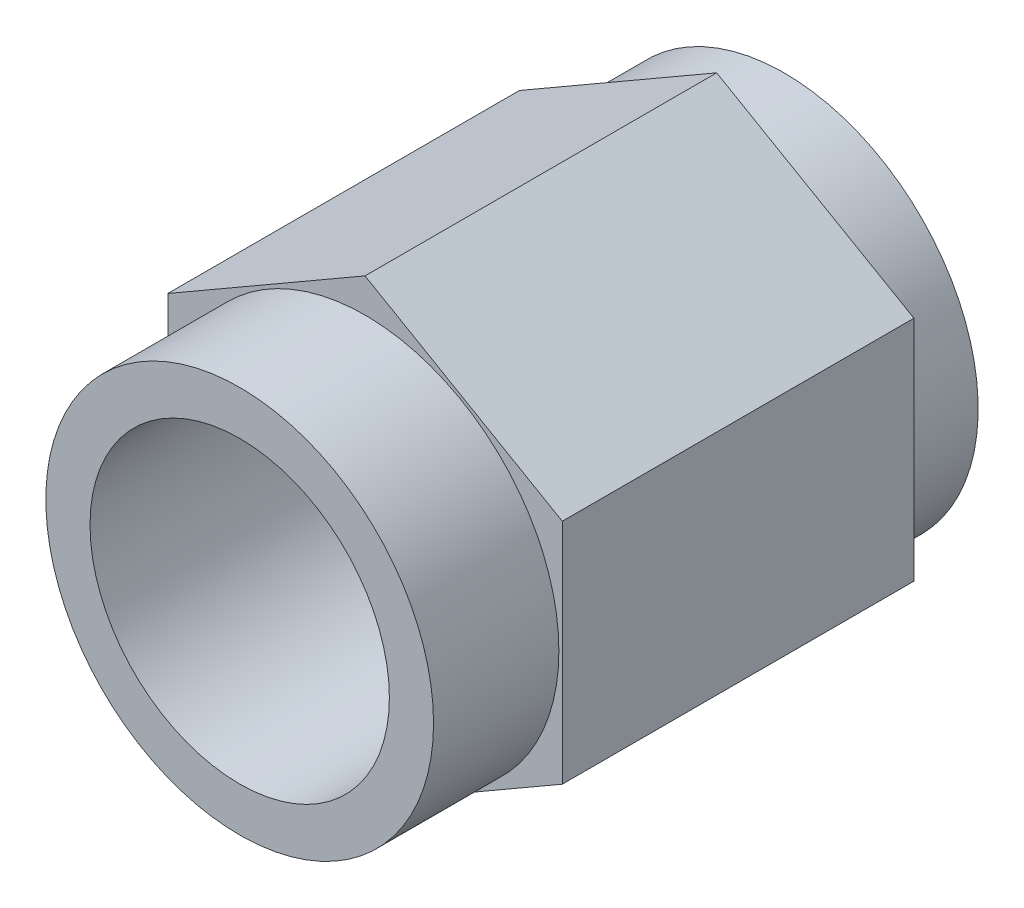
ISO-10303-21;
HEADER;
FILE_DESCRIPTION(('STEP AP214'),'2;1');
FILE_NAME('part.step','',(''),(''),'','','');
FILE_SCHEMA(('AUTOMOTIVE_DESIGN { 1 0 10303 214 1 1 1 1 }'));
ENDSEC;
DATA;
#1=APPLICATION_CONTEXT('core data for automotive mechanical design processes');
#2=APPLICATION_PROTOCOL_DEFINITION('international standard','automotive_design',2000,#1);
#3=PRODUCT_CONTEXT('',#1,'mechanical');
#4=PRODUCT('Part','Part','',(#3));
#5=PRODUCT_RELATED_PRODUCT_CATEGORY('part','',(#4));
#6=PRODUCT_DEFINITION_FORMATION('','',#4);
#7=PRODUCT_DEFINITION_CONTEXT('part definition',#1,'design');
#8=PRODUCT_DEFINITION('design','',#6,#7);
#9=PRODUCT_DEFINITION_SHAPE('','',#8);
#10=(LENGTH_UNIT() NAMED_UNIT(*) SI_UNIT(.MILLI.,.METRE.));
#11=(NAMED_UNIT(*) PLANE_ANGLE_UNIT() SI_UNIT($,.RADIAN.));
#12=(NAMED_UNIT(*) SI_UNIT($,.STERADIAN.) SOLID_ANGLE_UNIT());
#13=UNCERTAINTY_MEASURE_WITH_UNIT(LENGTH_MEASURE(1.E-05),#10,'distance_accuracy_value','');
#14=(GEOMETRIC_REPRESENTATION_CONTEXT(3) GLOBAL_UNCERTAINTY_ASSIGNED_CONTEXT((#13)) GLOBAL_UNIT_ASSIGNED_CONTEXT((#10,
#11,#12)) REPRESENTATION_CONTEXT('',''));
#15=CARTESIAN_POINT('',(0.,0.,0.));
#16=DIRECTION('',(0.,0.,1.));
#17=DIRECTION('',(1.,0.,0.));
#18=AXIS2_PLACEMENT_3D('',#15,#16,#17);
#19=CARTESIAN_POINT('',(0.,-6.41580486636972,11.811));
#20=DIRECTION('',(-0.5,0.866025403784439,0.));
#21=DIRECTION('',(-0.866025403784439,-0.5,0.));
#22=AXIS2_PLACEMENT_3D('',#19,#20,#21);
#23=PLANE('',#22);
#24=DIRECTION('',(-0.866025403784439,-0.5,0.));
#25=VECTOR('',#24,1.);
#26=CARTESIAN_POINT('',(0.,-6.41580486636972,1.905));
#27=LINE('',#26,#25);
#28=CARTESIAN_POINT('',(5.55625000000001,-3.20790243318485,1.905));
#29=VERTEX_POINT('',#28);
#30=CARTESIAN_POINT('',(0.,-6.41580486636972,1.905));
#31=VERTEX_POINT('',#30);
#32=EDGE_CURVE('E50',#29,#31,#27,.T.);
#33=ORIENTED_EDGE('',*,*,#32,.F.);
#34=DIRECTION('',(0.,0.,-1.));
#35=VECTOR('',#34,1.);
#36=CARTESIAN_POINT('',(5.55625000000001,-3.20790243318485,11.811));
#37=LINE('',#36,#35);
#38=CARTESIAN_POINT('',(5.55625000000001,-3.20790243318485,11.811));
#39=VERTEX_POINT('',#38);
#40=EDGE_CURVE('E44',#39,#29,#37,.T.);
#41=ORIENTED_EDGE('',*,*,#40,.F.);
#42=DIRECTION('',(0.866025403784439,0.5,0.));
#43=VECTOR('',#42,1.);
#44=CARTESIAN_POINT('',(0.,-6.41580486636972,11.811));
#45=LINE('',#44,#43);
#46=CARTESIAN_POINT('',(0.,-6.41580486636972,11.811));
#47=VERTEX_POINT('',#46);
#48=EDGE_CURVE('E144',#47,#39,#45,.T.);
#49=ORIENTED_EDGE('',*,*,#48,.F.);
#50=DIRECTION('',(0.,0.,-1.));
#51=VECTOR('',#50,1.);
#52=CARTESIAN_POINT('',(0.,-6.41580486636972,11.811));
#53=LINE('',#52,#51);
#54=EDGE_CURVE('E105',#47,#31,#53,.T.);
#55=ORIENTED_EDGE('',*,*,#54,.T.);
#56=EDGE_LOOP('',(#33,#41,#49,#55));
#57=FACE_BOUND('',#56,.T.);
#58=ADVANCED_FACE('F37',(#57),#23,.F.);
#59=CARTESIAN_POINT('',(5.55625000000001,-3.20790243318485,11.811));
#60=DIRECTION('',(-1.,0.,0.));
#61=DIRECTION('',(0.,0.,1.));
#62=AXIS2_PLACEMENT_3D('',#59,#60,#61);
#63=PLANE('',#62);
#64=DIRECTION('',(0.,-1.,0.));
#65=VECTOR('',#64,1.);
#66=CARTESIAN_POINT('',(5.55625000000001,-3.20790243318485,1.905));
#67=LINE('',#66,#65);
#68=CARTESIAN_POINT('',(5.55625000000001,3.20790243318485,1.905));
#69=VERTEX_POINT('',#68);
#70=EDGE_CURVE('E165',#69,#29,#67,.T.);
#71=ORIENTED_EDGE('',*,*,#70,.F.);
#72=DIRECTION('',(0.,0.,-1.));
#73=VECTOR('',#72,1.);
#74=CARTESIAN_POINT('',(5.55625000000001,3.20790243318485,11.811));
#75=LINE('',#74,#73);
#76=CARTESIAN_POINT('',(5.55625000000001,3.20790243318485,11.811));
#77=VERTEX_POINT('',#76);
#78=EDGE_CURVE('E114',#77,#69,#75,.T.);
#79=ORIENTED_EDGE('',*,*,#78,.F.);
#80=DIRECTION('',(0.,1.,0.));
#81=VECTOR('',#80,1.);
#82=CARTESIAN_POINT('',(5.55625000000001,-3.20790243318485,11.811));
#83=LINE('',#82,#81);
#84=EDGE_CURVE('E148',#39,#77,#83,.T.);
#85=ORIENTED_EDGE('',*,*,#84,.F.);
#86=ORIENTED_EDGE('',*,*,#40,.T.);
#87=EDGE_LOOP('',(#71,#79,#85,#86));
#88=FACE_BOUND('',#87,.T.);
#89=ADVANCED_FACE('F190',(#88),#63,.F.);
#90=CARTESIAN_POINT('',(5.55625000000001,3.20790243318485,11.811));
#91=DIRECTION('',(-0.5,-0.866025403784439,0.));
#92=DIRECTION('',(0.866025403784439,-0.5,0.));
#93=AXIS2_PLACEMENT_3D('',#90,#91,#92);
#94=PLANE('',#93);
#95=DIRECTION('',(0.866025403784439,-0.5,0.));
#96=VECTOR('',#95,1.);
#97=CARTESIAN_POINT('',(5.55625000000001,3.20790243318485,1.905));
#98=LINE('',#97,#96);
#99=CARTESIAN_POINT('',(0.,6.41580486636972,1.905));
#100=VERTEX_POINT('',#99);
#101=EDGE_CURVE('E163',#100,#69,#98,.T.);
#102=ORIENTED_EDGE('',*,*,#101,.F.);
#103=DIRECTION('',(0.,0.,-1.));
#104=VECTOR('',#103,1.);
#105=CARTESIAN_POINT('',(0.,6.41580486636972,11.811));
#106=LINE('',#105,#104);
#107=CARTESIAN_POINT('',(0.,6.41580486636972,11.811));
#108=VERTEX_POINT('',#107);
#109=EDGE_CURVE('E107',#108,#100,#106,.T.);
#110=ORIENTED_EDGE('',*,*,#109,.F.);
#111=DIRECTION('',(-0.866025403784439,0.5,0.));
#112=VECTOR('',#111,1.);
#113=CARTESIAN_POINT('',(5.55625000000001,3.20790243318485,11.811));
#114=LINE('',#113,#112);
#115=EDGE_CURVE('E150',#77,#108,#114,.T.);
#116=ORIENTED_EDGE('',*,*,#115,.F.);
#117=ORIENTED_EDGE('',*,*,#78,.T.);
#118=EDGE_LOOP('',(#102,#110,#116,#117));
#119=FACE_BOUND('',#118,.T.);
#120=ADVANCED_FACE('F195',(#119),#94,.F.);
#121=CARTESIAN_POINT('',(0.,6.41580486636972,11.811));
#122=DIRECTION('',(0.5,-0.866025403784438,0.));
#123=DIRECTION('',(0.866025403784438,0.500000000000001,0.));
#124=AXIS2_PLACEMENT_3D('',#121,#122,#123);
#125=PLANE('',#124);
#126=DIRECTION('',(0.866025403784438,0.500000000000001,0.));
#127=VECTOR('',#126,1.);
#128=CARTESIAN_POINT('',(0.,6.41580486636972,1.905));
#129=LINE('',#128,#127);
#130=CARTESIAN_POINT('',(-5.55625,3.20790243318486,1.905));
#131=VERTEX_POINT('',#130);
#132=EDGE_CURVE('E101',#131,#100,#129,.T.);
#133=ORIENTED_EDGE('',*,*,#132,.F.);
#134=DIRECTION('',(0.,0.,-1.));
#135=VECTOR('',#134,1.);
#136=CARTESIAN_POINT('',(-5.55625,3.20790243318486,11.811));
#137=LINE('',#136,#135);
#138=CARTESIAN_POINT('',(-5.55625,3.20790243318486,11.811));
#139=VERTEX_POINT('',#138);
#140=EDGE_CURVE('E100',#139,#131,#137,.T.);
#141=ORIENTED_EDGE('',*,*,#140,.F.);
#142=DIRECTION('',(-0.866025403784438,-0.500000000000001,0.));
#143=VECTOR('',#142,1.);
#144=CARTESIAN_POINT('',(0.,6.41580486636972,11.811));
#145=LINE('',#144,#143);
#146=EDGE_CURVE('E152',#108,#139,#145,.T.);
#147=ORIENTED_EDGE('',*,*,#146,.F.);
#148=ORIENTED_EDGE('',*,*,#109,.T.);
#149=EDGE_LOOP('',(#133,#141,#147,#148));
#150=FACE_BOUND('',#149,.T.);
#151=ADVANCED_FACE('F161',(#150),#125,.F.);
#152=CARTESIAN_POINT('',(-5.55625,3.20790243318486,11.811));
#153=DIRECTION('',(1.,0.,0.));
#154=DIRECTION('',(0.,0.,-1.));
#155=AXIS2_PLACEMENT_3D('',#152,#153,#154);
#156=PLANE('',#155);
#157=DIRECTION('',(0.,1.,0.));
#158=VECTOR('',#157,1.);
#159=CARTESIAN_POINT('',(-5.55625,3.20790243318486,1.905));
#160=LINE('',#159,#158);
#161=CARTESIAN_POINT('',(-5.55625,-3.20790243318486,1.905));
#162=VERTEX_POINT('',#161);
#163=EDGE_CURVE('E88',#162,#131,#160,.T.);
#164=ORIENTED_EDGE('',*,*,#163,.F.);
#165=DIRECTION('',(0.,0.,-1.));
#166=VECTOR('',#165,1.);
#167=CARTESIAN_POINT('',(-5.55625,-3.20790243318486,11.811));
#168=LINE('',#167,#166);
#169=CARTESIAN_POINT('',(-5.55625,-3.20790243318486,11.811));
#170=VERTEX_POINT('',#169);
#171=EDGE_CURVE('E98',#170,#162,#168,.T.);
#172=ORIENTED_EDGE('',*,*,#171,.F.);
#173=DIRECTION('',(0.,-1.,0.));
#174=VECTOR('',#173,1.);
#175=CARTESIAN_POINT('',(-5.55625,3.20790243318486,11.811));
#176=LINE('',#175,#174);
#177=EDGE_CURVE('E154',#139,#170,#176,.T.);
#178=ORIENTED_EDGE('',*,*,#177,.F.);
#179=ORIENTED_EDGE('',*,*,#140,.T.);
#180=EDGE_LOOP('',(#164,#172,#178,#179));
#181=FACE_BOUND('',#180,.T.);
#182=ADVANCED_FACE('F96',(#181),#156,.F.);
#183=CARTESIAN_POINT('',(-5.55625,-3.20790243318486,11.811));
#184=DIRECTION('',(0.5,0.866025403784438,0.));
#185=DIRECTION('',(-0.866025403784438,0.500000000000001,0.));
#186=AXIS2_PLACEMENT_3D('',#183,#184,#185);
#187=PLANE('',#186);
#188=DIRECTION('',(-0.866025403784438,0.500000000000001,0.));
#189=VECTOR('',#188,1.);
#190=CARTESIAN_POINT('',(-5.55625,-3.20790243318486,1.905));
#191=LINE('',#190,#189);
#192=EDGE_CURVE('E12',#31,#162,#191,.T.);
#193=ORIENTED_EDGE('',*,*,#192,.F.);
#194=ORIENTED_EDGE('',*,*,#54,.F.);
#195=DIRECTION('',(0.866025403784438,-0.500000000000001,0.));
#196=VECTOR('',#195,1.);
#197=CARTESIAN_POINT('',(-5.55625,-3.20790243318486,11.811));
#198=LINE('',#197,#196);
#199=EDGE_CURVE('E58',#170,#47,#198,.T.);
#200=ORIENTED_EDGE('',*,*,#199,.F.);
#201=ORIENTED_EDGE('',*,*,#171,.T.);
#202=EDGE_LOOP('',(#193,#194,#200,#201));
#203=FACE_BOUND('',#202,.T.);
#204=ADVANCED_FACE('F104',(#203),#187,.F.);
#205=CARTESIAN_POINT('',(0.,0.,0.));
#206=DIRECTION('',(0.,0.,1.));
#207=DIRECTION('',(1.,0.,0.));
#208=AXIS2_PLACEMENT_3D('',#205,#206,#207);
#209=PLANE('',#208);
#210=CARTESIAN_POINT('',(0.,0.,0.));
#211=DIRECTION('',(0.,0.,-1.));
#212=DIRECTION('',(-1.,0.,0.));
#213=AXIS2_PLACEMENT_3D('',#210,#211,#212);
#214=CIRCLE('',#213,3.07975);
#215=CARTESIAN_POINT('',(-3.07975,0.,0.));
#216=VERTEX_POINT('',#215);
#217=EDGE_CURVE('E124',#216,#216,#214,.T.);
#218=ORIENTED_EDGE('',*,*,#217,.F.);
#219=EDGE_LOOP('',(#218));
#220=FACE_BOUND('',#219,.T.);
#221=CARTESIAN_POINT('',(0.,0.,0.));
#222=DIRECTION('',(0.,0.,-1.));
#223=DIRECTION('',(-1.,0.,0.));
#224=AXIS2_PLACEMENT_3D('',#221,#222,#223);
#225=CIRCLE('',#224,5.461);
#226=CARTESIAN_POINT('',(-5.461,0.,0.));
#227=VERTEX_POINT('',#226);
#228=EDGE_CURVE('E332',#227,#227,#225,.T.);
#229=ORIENTED_EDGE('',*,*,#228,.T.);
#230=EDGE_LOOP('',(#229));
#231=FACE_BOUND('',#230,.T.);
#232=ADVANCED_FACE('F213',(#220,#231),#209,.F.);
#233=CARTESIAN_POINT('',(0.,0.,15.3416));
#234=DIRECTION('',(0.,0.,-1.));
#235=DIRECTION('',(-1.,0.,0.));
#236=AXIS2_PLACEMENT_3D('',#233,#234,#235);
#237=CYLINDRICAL_SURFACE('',#236,3.07975);
#238=ORIENTED_EDGE('',*,*,#217,.T.);
#239=EDGE_LOOP('',(#238));
#240=FACE_BOUND('',#239,.T.);
#241=CARTESIAN_POINT('',(0.,0.,1.3716));
#242=DIRECTION('',(0.,0.,1.));
#243=DIRECTION('',(1.,0.,0.));
#244=AXIS2_PLACEMENT_3D('',#241,#242,#243);
#245=CIRCLE('',#244,3.07975);
#246=CARTESIAN_POINT('',(3.07975,0.,1.3716));
#247=VERTEX_POINT('',#246);
#248=EDGE_CURVE('E119',#247,#247,#245,.F.);
#249=ORIENTED_EDGE('',*,*,#248,.F.);
#250=EDGE_LOOP('',(#249));
#251=FACE_BOUND('',#250,.T.);
#252=ADVANCED_FACE('F216',(#240,#251),#237,.F.);
#253=CARTESIAN_POINT('',(0.,0.,11.811));
#254=DIRECTION('',(0.,0.,1.));
#255=DIRECTION('',(1.,0.,0.));
#256=AXIS2_PLACEMENT_3D('',#253,#254,#255);
#257=PLANE('',#256);
#258=ORIENTED_EDGE('',*,*,#48,.T.);
#259=ORIENTED_EDGE('',*,*,#84,.T.);
#260=ORIENTED_EDGE('',*,*,#115,.T.);
#261=ORIENTED_EDGE('',*,*,#146,.T.);
#262=ORIENTED_EDGE('',*,*,#177,.T.);
#263=ORIENTED_EDGE('',*,*,#199,.T.);
#264=EDGE_LOOP('',(#258,#259,#260,#261,#262,#263));
#265=FACE_BOUND('',#264,.T.);
#266=CARTESIAN_POINT('',(0.,0.,11.811));
#267=DIRECTION('',(0.,0.,1.));
#268=DIRECTION('',(1.,0.,0.));
#269=AXIS2_PLACEMENT_3D('',#266,#267,#268);
#270=CIRCLE('',#269,5.461);
#271=CARTESIAN_POINT('',(5.461,0.,11.811));
#272=VERTEX_POINT('',#271);
#273=EDGE_CURVE('E140',#272,#272,#270,.T.);
#274=ORIENTED_EDGE('',*,*,#273,.F.);
#275=EDGE_LOOP('',(#274));
#276=FACE_BOUND('',#275,.T.);
#277=ADVANCED_FACE('F155',(#265,#276),#257,.T.);
#278=CARTESIAN_POINT('',(0.,0.,15.3416));
#279=DIRECTION('',(0.,0.,-1.));
#280=DIRECTION('',(-1.,0.,0.));
#281=AXIS2_PLACEMENT_3D('',#278,#279,#280);
#282=CYLINDRICAL_SURFACE('',#281,5.461);
#283=CARTESIAN_POINT('',(0.,0.,15.3416));
#284=DIRECTION('',(0.,0.,1.));
#285=DIRECTION('',(1.,0.,0.));
#286=AXIS2_PLACEMENT_3D('',#283,#284,#285);
#287=CIRCLE('',#286,5.461);
#288=CARTESIAN_POINT('',(5.461,0.,15.3416));
#289=VERTEX_POINT('',#288);
#290=EDGE_CURVE('E141',#289,#289,#287,.T.);
#291=ORIENTED_EDGE('',*,*,#290,.F.);
#292=EDGE_LOOP('',(#291));
#293=FACE_BOUND('',#292,.T.);
#294=ORIENTED_EDGE('',*,*,#273,.T.);
#295=EDGE_LOOP('',(#294));
#296=FACE_BOUND('',#295,.T.);
#297=ADVANCED_FACE('F220',(#293,#296),#282,.T.);
#298=CARTESIAN_POINT('',(0.,0.,15.3416));
#299=DIRECTION('',(0.,0.,1.));
#300=DIRECTION('',(1.,0.,0.));
#301=AXIS2_PLACEMENT_3D('',#298,#299,#300);
#302=PLANE('',#301);
#303=CARTESIAN_POINT('',(0.,0.,15.3416));
#304=DIRECTION('',(0.,0.,1.));
#305=DIRECTION('',(1.,0.,0.));
#306=AXIS2_PLACEMENT_3D('',#303,#304,#305);
#307=CIRCLE('',#306,4.21639999999999);
#308=CARTESIAN_POINT('',(4.21639999999999,0.,15.3416));
#309=VERTEX_POINT('',#308);
#310=EDGE_CURVE('E128',#309,#309,#307,.T.);
#311=ORIENTED_EDGE('',*,*,#310,.F.);
#312=EDGE_LOOP('',(#311));
#313=FACE_BOUND('',#312,.T.);
#314=ORIENTED_EDGE('',*,*,#290,.T.);
#315=EDGE_LOOP('',(#314));
#316=FACE_BOUND('',#315,.T.);
#317=ADVANCED_FACE('F223',(#313,#316),#302,.T.);
#318=CARTESIAN_POINT('',(0.,0.,3.2766));
#319=DIRECTION('',(0.,0.,1.));
#320=DIRECTION('',(1.,0.,0.));
#321=AXIS2_PLACEMENT_3D('',#318,#319,#320);
#322=CONICAL_SURFACE('',#321,4.2164,1.02974425867665);
#323=CARTESIAN_POINT('',(0.,0.,3.23844535069175));
#324=DIRECTION('',(0.,0.,1.));
#325=DIRECTION('',(1.,0.,0.));
#326=AXIS2_PLACEMENT_3D('',#323,#324,#325);
#327=CIRCLE('',#326,4.1529);
#328=CARTESIAN_POINT('',(4.1529,0.,3.23844535069175));
#329=VERTEX_POINT('',#328);
#330=EDGE_CURVE('E121',#329,#329,#327,.F.);
#331=ORIENTED_EDGE('',*,*,#330,.T.);
#332=EDGE_LOOP('',(#331));
#333=FACE_BOUND('',#332,.T.);
#334=CARTESIAN_POINT('',(0.,0.,3.2766));
#335=DIRECTION('',(0.,0.,1.));
#336=DIRECTION('',(1.,0.,0.));
#337=AXIS2_PLACEMENT_3D('',#334,#335,#336);
#338=CIRCLE('',#337,4.2164);
#339=CARTESIAN_POINT('',(4.2164,0.,3.2766));
#340=VERTEX_POINT('',#339);
#341=EDGE_CURVE('E133',#340,#340,#338,.T.);
#342=ORIENTED_EDGE('',*,*,#341,.T.);
#343=EDGE_LOOP('',(#342));
#344=FACE_BOUND('',#343,.T.);
#345=ADVANCED_FACE('F185',(#333,#344),#322,.F.);
#346=CARTESIAN_POINT('',(0.,0.,15.3416));
#347=DIRECTION('',(0.,0.,1.));
#348=DIRECTION('',(1.,0.,0.));
#349=AXIS2_PLACEMENT_3D('',#346,#347,#348);
#350=CYLINDRICAL_SURFACE('',#349,4.21639999999999);
#351=ORIENTED_EDGE('',*,*,#341,.F.);
#352=EDGE_LOOP('',(#351));
#353=FACE_BOUND('',#352,.T.);
#354=ORIENTED_EDGE('',*,*,#310,.T.);
#355=EDGE_LOOP('',(#354));
#356=FACE_BOUND('',#355,.T.);
#357=ADVANCED_FACE('F178',(#353,#356),#350,.F.);
#358=CARTESIAN_POINT('',(0.,0.,1.3716));
#359=DIRECTION('',(0.,0.,1.));
#360=DIRECTION('',(1.,0.,0.));
#361=AXIS2_PLACEMENT_3D('',#358,#359,#360);
#362=CYLINDRICAL_SURFACE('',#361,4.1529);
#363=CARTESIAN_POINT('',(0.,0.,1.3716));
#364=DIRECTION('',(0.,0.,1.));
#365=DIRECTION('',(1.,0.,0.));
#366=AXIS2_PLACEMENT_3D('',#363,#364,#365);
#367=CIRCLE('',#366,4.1529);
#368=CARTESIAN_POINT('',(4.1529,0.,1.3716));
#369=VERTEX_POINT('',#368);
#370=EDGE_CURVE('E122',#369,#369,#367,.T.);
#371=ORIENTED_EDGE('',*,*,#370,.F.);
#372=EDGE_LOOP('',(#371));
#373=FACE_BOUND('',#372,.T.);
#374=ORIENTED_EDGE('',*,*,#330,.F.);
#375=EDGE_LOOP('',(#374));
#376=FACE_BOUND('',#375,.T.);
#377=ADVANCED_FACE('F175',(#373,#376),#362,.F.);
#378=CARTESIAN_POINT('',(0.,0.,1.3716));
#379=DIRECTION('',(0.,0.,1.));
#380=DIRECTION('',(1.,0.,0.));
#381=AXIS2_PLACEMENT_3D('',#378,#379,#380);
#382=PLANE('',#381);
#383=ORIENTED_EDGE('',*,*,#370,.T.);
#384=EDGE_LOOP('',(#383));
#385=FACE_BOUND('',#384,.T.);
#386=ORIENTED_EDGE('',*,*,#248,.T.);
#387=EDGE_LOOP('',(#386));
#388=FACE_BOUND('',#387,.T.);
#389=ADVANCED_FACE('F172',(#385,#388),#382,.T.);
#390=CARTESIAN_POINT('',(0.,0.,1.905));
#391=DIRECTION('',(0.,0.,-1.));
#392=DIRECTION('',(-1.,0.,0.));
#393=AXIS2_PLACEMENT_3D('',#390,#391,#392);
#394=PLANE('',#393);
#395=CARTESIAN_POINT('',(0.,0.,1.905));
#396=DIRECTION('',(0.,0.,-1.));
#397=DIRECTION('',(-1.,0.,0.));
#398=AXIS2_PLACEMENT_3D('',#395,#396,#397);
#399=CIRCLE('',#398,5.461);
#400=CARTESIAN_POINT('',(-5.461,0.,1.905));
#401=VERTEX_POINT('',#400);
#402=EDGE_CURVE('E102',#401,#401,#399,.T.);
#403=ORIENTED_EDGE('',*,*,#402,.F.);
#404=EDGE_LOOP('',(#403));
#405=FACE_BOUND('',#404,.T.);
#406=ORIENTED_EDGE('',*,*,#32,.T.);
#407=ORIENTED_EDGE('',*,*,#192,.T.);
#408=ORIENTED_EDGE('',*,*,#163,.T.);
#409=ORIENTED_EDGE('',*,*,#132,.T.);
#410=ORIENTED_EDGE('',*,*,#101,.T.);
#411=ORIENTED_EDGE('',*,*,#70,.T.);
#412=EDGE_LOOP('',(#406,#407,#408,#409,#410,#411));
#413=FACE_BOUND('',#412,.T.);
#414=ADVANCED_FACE('F87',(#405,#413),#394,.T.);
#415=CARTESIAN_POINT('',(0.,0.,1.905));
#416=DIRECTION('',(0.,0.,-1.));
#417=DIRECTION('',(-1.,0.,0.));
#418=AXIS2_PLACEMENT_3D('',#415,#416,#417);
#419=CYLINDRICAL_SURFACE('',#418,5.461);
#420=ORIENTED_EDGE('',*,*,#402,.T.);
#421=EDGE_LOOP('',(#420));
#422=FACE_BOUND('',#421,.T.);
#423=ORIENTED_EDGE('',*,*,#228,.F.);
#424=EDGE_LOOP('',(#423));
#425=FACE_BOUND('',#424,.T.);
#426=ADVANCED_FACE('F313',(#422,#425),#419,.T.);
#427=CLOSED_SHELL('',(#58,#89,#120,#151,#182,#204,#232,#252,#277,#297,#317,#345,#357,#377,#389,
#414,#426));
#428=MANIFOLD_SOLID_BREP('B2',#427);
#429=ADVANCED_BREP_SHAPE_REPRESENTATION('',(#18,#428),#14);
#430=SHAPE_DEFINITION_REPRESENTATION(#9,#429);
ENDSEC;
END-ISO-10303-21;
